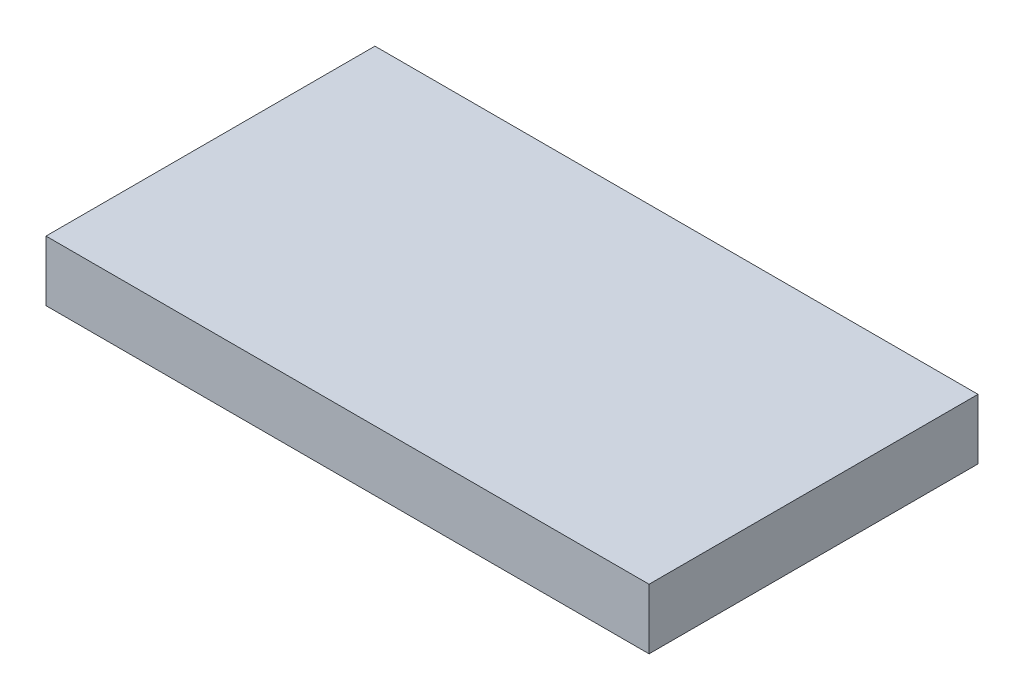
ISO-10303-21;
HEADER;
FILE_DESCRIPTION(('STEP AP214'),'2;1');
FILE_NAME('part.step','',(''),(''),'','','');
FILE_SCHEMA(('AUTOMOTIVE_DESIGN { 1 0 10303 214 1 1 1 1 }'));
ENDSEC;
DATA;
#1=APPLICATION_CONTEXT('core data for automotive mechanical design processes');
#2=APPLICATION_PROTOCOL_DEFINITION('international standard','automotive_design',2000,#1);
#3=PRODUCT_CONTEXT('',#1,'mechanical');
#4=PRODUCT('Part','Part','',(#3));
#5=PRODUCT_RELATED_PRODUCT_CATEGORY('part','',(#4));
#6=PRODUCT_DEFINITION_FORMATION('','',#4);
#7=PRODUCT_DEFINITION_CONTEXT('part definition',#1,'design');
#8=PRODUCT_DEFINITION('design','',#6,#7);
#9=PRODUCT_DEFINITION_SHAPE('','',#8);
#10=(LENGTH_UNIT() NAMED_UNIT(*) SI_UNIT(.MILLI.,.METRE.));
#11=(NAMED_UNIT(*) PLANE_ANGLE_UNIT() SI_UNIT($,.RADIAN.));
#12=(NAMED_UNIT(*) SI_UNIT($,.STERADIAN.) SOLID_ANGLE_UNIT());
#13=UNCERTAINTY_MEASURE_WITH_UNIT(LENGTH_MEASURE(1.E-05),#10,'distance_accuracy_value','');
#14=(GEOMETRIC_REPRESENTATION_CONTEXT(3) GLOBAL_UNCERTAINTY_ASSIGNED_CONTEXT((#13)) GLOBAL_UNIT_ASSIGNED_CONTEXT((#10,
#11,#12)) REPRESENTATION_CONTEXT('',''));
#15=CARTESIAN_POINT('',(0.,0.,0.));
#16=DIRECTION('',(0.,0.,1.));
#17=DIRECTION('',(1.,0.,0.));
#18=AXIS2_PLACEMENT_3D('',#15,#16,#17);
#19=CARTESIAN_POINT('',(8.25,1.65,4.5));
#20=DIRECTION('',(-1.,0.,0.));
#21=DIRECTION('',(0.,0.,1.));
#22=AXIS2_PLACEMENT_3D('',#19,#20,#21);
#23=PLANE('',#22);
#24=DIRECTION('',(0.,0.,-1.));
#25=VECTOR('',#24,1.);
#26=CARTESIAN_POINT('',(8.25,0.,4.5));
#27=LINE('',#26,#25);
#28=CARTESIAN_POINT('',(8.25,0.,4.5));
#29=VERTEX_POINT('',#28);
#30=CARTESIAN_POINT('',(8.25,0.,-4.5));
#31=VERTEX_POINT('',#30);
#32=EDGE_CURVE('E96',#29,#31,#27,.T.);
#33=ORIENTED_EDGE('',*,*,#32,.T.);
#34=DIRECTION('',(0.,-1.,0.));
#35=VECTOR('',#34,1.);
#36=CARTESIAN_POINT('',(8.25,1.65,-4.5));
#37=LINE('',#36,#35);
#38=CARTESIAN_POINT('',(8.25,1.65,-4.5));
#39=VERTEX_POINT('',#38);
#40=EDGE_CURVE('E11',#39,#31,#37,.T.);
#41=ORIENTED_EDGE('',*,*,#40,.F.);
#42=DIRECTION('',(0.,0.,-1.));
#43=VECTOR('',#42,1.);
#44=CARTESIAN_POINT('',(8.25,1.65,4.5));
#45=LINE('',#44,#43);
#46=CARTESIAN_POINT('',(8.25,1.65,4.5));
#47=VERTEX_POINT('',#46);
#48=EDGE_CURVE('E84',#47,#39,#45,.T.);
#49=ORIENTED_EDGE('',*,*,#48,.F.);
#50=DIRECTION('',(0.,-1.,0.));
#51=VECTOR('',#50,1.);
#52=CARTESIAN_POINT('',(8.25,1.65,4.5));
#53=LINE('',#52,#51);
#54=EDGE_CURVE('E92',#47,#29,#53,.T.);
#55=ORIENTED_EDGE('',*,*,#54,.T.);
#56=EDGE_LOOP('',(#33,#41,#49,#55));
#57=FACE_BOUND('',#56,.T.);
#58=ADVANCED_FACE('F33',(#57),#23,.F.);
#59=CARTESIAN_POINT('',(-8.25,1.65,-4.5));
#60=DIRECTION('',(0.,0.,1.));
#61=DIRECTION('',(1.,0.,0.));
#62=AXIS2_PLACEMENT_3D('',#59,#60,#61);
#63=PLANE('',#62);
#64=DIRECTION('',(-1.,0.,0.));
#65=VECTOR('',#64,1.);
#66=CARTESIAN_POINT('',(-8.25,0.,-4.5));
#67=LINE('',#66,#65);
#68=CARTESIAN_POINT('',(-8.25,0.,-4.5));
#69=VERTEX_POINT('',#68);
#70=EDGE_CURVE('E88',#31,#69,#67,.T.);
#71=ORIENTED_EDGE('',*,*,#70,.T.);
#72=DIRECTION('',(0.,-1.,0.));
#73=VECTOR('',#72,1.);
#74=CARTESIAN_POINT('',(-8.25,1.65,-4.5));
#75=LINE('',#74,#73);
#76=CARTESIAN_POINT('',(-8.25,1.65,-4.5));
#77=VERTEX_POINT('',#76);
#78=EDGE_CURVE('E41',#77,#69,#75,.T.);
#79=ORIENTED_EDGE('',*,*,#78,.F.);
#80=DIRECTION('',(-1.,0.,0.));
#81=VECTOR('',#80,1.);
#82=CARTESIAN_POINT('',(-8.25,1.65,-4.5));
#83=LINE('',#82,#81);
#84=EDGE_CURVE('E79',#39,#77,#83,.T.);
#85=ORIENTED_EDGE('',*,*,#84,.F.);
#86=ORIENTED_EDGE('',*,*,#40,.T.);
#87=EDGE_LOOP('',(#71,#79,#85,#86));
#88=FACE_BOUND('',#87,.T.);
#89=ADVANCED_FACE('F87',(#88),#63,.F.);
#90=CARTESIAN_POINT('',(-8.25,1.65,4.5));
#91=DIRECTION('',(1.,0.,0.));
#92=DIRECTION('',(0.,0.,-1.));
#93=AXIS2_PLACEMENT_3D('',#90,#91,#92);
#94=PLANE('',#93);
#95=DIRECTION('',(0.,0.,1.));
#96=VECTOR('',#95,1.);
#97=CARTESIAN_POINT('',(-8.25,0.,4.5));
#98=LINE('',#97,#96);
#99=CARTESIAN_POINT('',(-8.25,0.,4.5));
#100=VERTEX_POINT('',#99);
#101=EDGE_CURVE('E66',#69,#100,#98,.T.);
#102=ORIENTED_EDGE('',*,*,#101,.T.);
#103=DIRECTION('',(0.,-1.,0.));
#104=VECTOR('',#103,1.);
#105=CARTESIAN_POINT('',(-8.25,1.65,4.5));
#106=LINE('',#105,#104);
#107=CARTESIAN_POINT('',(-8.25,1.65,4.5));
#108=VERTEX_POINT('',#107);
#109=EDGE_CURVE('E89',#108,#100,#106,.T.);
#110=ORIENTED_EDGE('',*,*,#109,.F.);
#111=DIRECTION('',(0.,0.,1.));
#112=VECTOR('',#111,1.);
#113=CARTESIAN_POINT('',(-8.25,1.65,4.5));
#114=LINE('',#113,#112);
#115=EDGE_CURVE('E82',#77,#108,#114,.T.);
#116=ORIENTED_EDGE('',*,*,#115,.F.);
#117=ORIENTED_EDGE('',*,*,#78,.T.);
#118=EDGE_LOOP('',(#102,#110,#116,#117));
#119=FACE_BOUND('',#118,.T.);
#120=ADVANCED_FACE('F90',(#119),#94,.F.);
#121=CARTESIAN_POINT('',(-8.25,1.65,4.5));
#122=DIRECTION('',(0.,0.,-1.));
#123=DIRECTION('',(-1.,0.,0.));
#124=AXIS2_PLACEMENT_3D('',#121,#122,#123);
#125=PLANE('',#124);
#126=DIRECTION('',(1.,0.,0.));
#127=VECTOR('',#126,1.);
#128=CARTESIAN_POINT('',(-8.25,0.,4.5));
#129=LINE('',#128,#127);
#130=EDGE_CURVE('E72',#100,#29,#129,.T.);
#131=ORIENTED_EDGE('',*,*,#130,.T.);
#132=ORIENTED_EDGE('',*,*,#54,.F.);
#133=DIRECTION('',(1.,0.,0.));
#134=VECTOR('',#133,1.);
#135=CARTESIAN_POINT('',(-8.25,1.65,4.5));
#136=LINE('',#135,#134);
#137=EDGE_CURVE('E49',#108,#47,#136,.T.);
#138=ORIENTED_EDGE('',*,*,#137,.F.);
#139=ORIENTED_EDGE('',*,*,#109,.T.);
#140=EDGE_LOOP('',(#131,#132,#138,#139));
#141=FACE_BOUND('',#140,.T.);
#142=ADVANCED_FACE('F103',(#141),#125,.F.);
#143=CARTESIAN_POINT('',(0.,1.65,0.));
#144=DIRECTION('',(0.,-1.,0.));
#145=DIRECTION('',(0.,0.,-1.));
#146=AXIS2_PLACEMENT_3D('',#143,#144,#145);
#147=PLANE('',#146);
#148=ORIENTED_EDGE('',*,*,#48,.T.);
#149=ORIENTED_EDGE('',*,*,#84,.T.);
#150=ORIENTED_EDGE('',*,*,#115,.T.);
#151=ORIENTED_EDGE('',*,*,#137,.T.);
#152=EDGE_LOOP('',(#148,#149,#150,#151));
#153=FACE_BOUND('',#152,.T.);
#154=ADVANCED_FACE('F80',(#153),#147,.F.);
#155=CARTESIAN_POINT('',(0.,0.,0.));
#156=DIRECTION('',(0.,-1.,0.));
#157=DIRECTION('',(0.,0.,-1.));
#158=AXIS2_PLACEMENT_3D('',#155,#156,#157);
#159=PLANE('',#158);
#160=ORIENTED_EDGE('',*,*,#32,.F.);
#161=ORIENTED_EDGE('',*,*,#130,.F.);
#162=ORIENTED_EDGE('',*,*,#101,.F.);
#163=ORIENTED_EDGE('',*,*,#70,.F.);
#164=EDGE_LOOP('',(#160,#161,#162,#163));
#165=FACE_BOUND('',#164,.T.);
#166=ADVANCED_FACE('F106',(#165),#159,.T.);
#167=CLOSED_SHELL('',(#58,#89,#120,#142,#154,#166));
#168=MANIFOLD_SOLID_BREP('B2',#167);
#169=ADVANCED_BREP_SHAPE_REPRESENTATION('',(#18,#168),#14);
#170=SHAPE_DEFINITION_REPRESENTATION(#9,#169);
ENDSEC;
END-ISO-10303-21;
